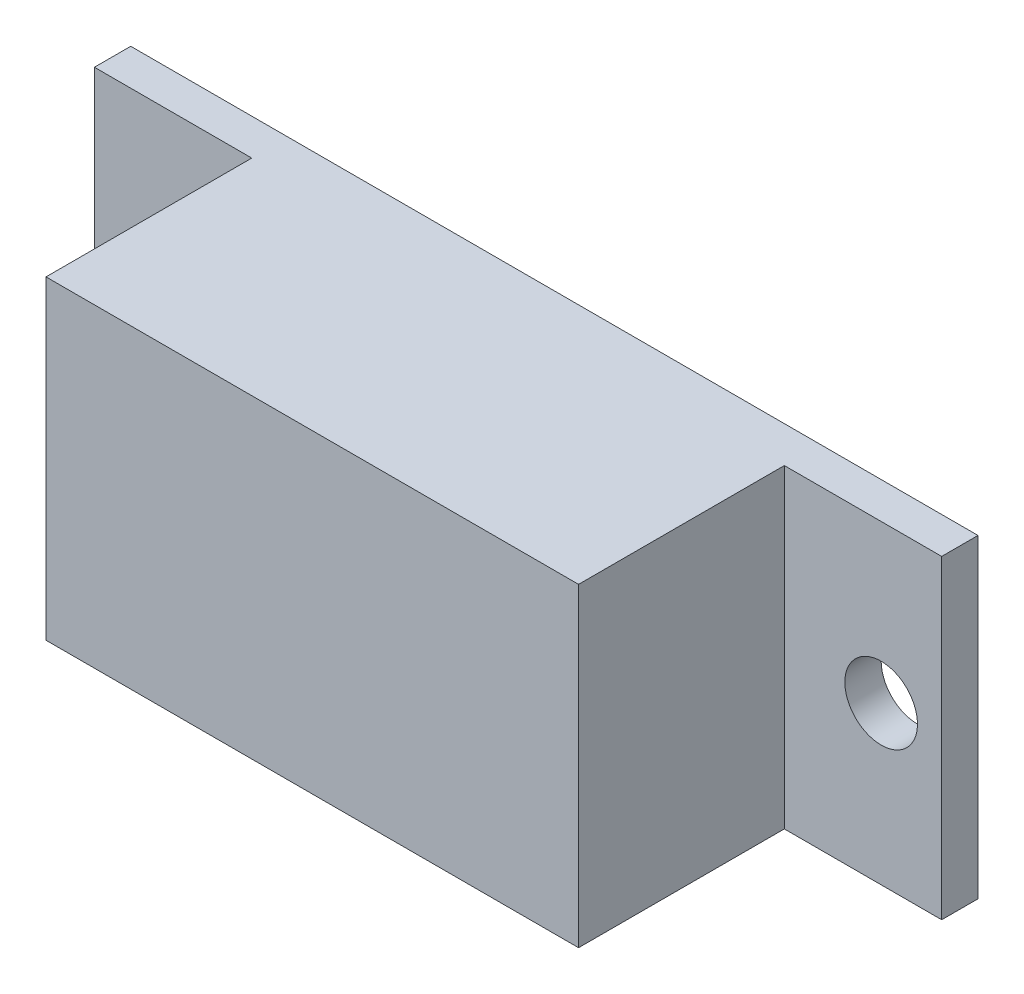
ISO-10303-21;
HEADER;
FILE_DESCRIPTION(('STEP AP214'),'2;1');
FILE_NAME('part.step','',(''),(''),'','','');
FILE_SCHEMA(('AUTOMOTIVE_DESIGN { 1 0 10303 214 1 1 1 1 }'));
ENDSEC;
DATA;
#1=APPLICATION_CONTEXT('core data for automotive mechanical design processes');
#2=APPLICATION_PROTOCOL_DEFINITION('international standard','automotive_design',2000,#1);
#3=PRODUCT_CONTEXT('',#1,'mechanical');
#4=PRODUCT('Part','Part','',(#3));
#5=PRODUCT_RELATED_PRODUCT_CATEGORY('part','',(#4));
#6=PRODUCT_DEFINITION_FORMATION('','',#4);
#7=PRODUCT_DEFINITION_CONTEXT('part definition',#1,'design');
#8=PRODUCT_DEFINITION('design','',#6,#7);
#9=PRODUCT_DEFINITION_SHAPE('','',#8);
#10=(LENGTH_UNIT() NAMED_UNIT(*) SI_UNIT(.MILLI.,.METRE.));
#11=(NAMED_UNIT(*) PLANE_ANGLE_UNIT() SI_UNIT($,.RADIAN.));
#12=(NAMED_UNIT(*) SI_UNIT($,.STERADIAN.) SOLID_ANGLE_UNIT());
#13=UNCERTAINTY_MEASURE_WITH_UNIT(LENGTH_MEASURE(1.E-05),#10,'distance_accuracy_value','');
#14=(GEOMETRIC_REPRESENTATION_CONTEXT(3) GLOBAL_UNCERTAINTY_ASSIGNED_CONTEXT((#13)) GLOBAL_UNIT_ASSIGNED_CONTEXT((#10,
#11,#12)) REPRESENTATION_CONTEXT('',''));
#15=CARTESIAN_POINT('',(0.,0.,0.));
#16=DIRECTION('',(0.,0.,1.));
#17=DIRECTION('',(1.,0.,0.));
#18=AXIS2_PLACEMENT_3D('',#15,#16,#17);
#19=CARTESIAN_POINT('',(0.,0.,1.5));
#20=DIRECTION('',(0.,0.,-1.));
#21=DIRECTION('',(-1.,0.,0.));
#22=AXIS2_PLACEMENT_3D('',#19,#20,#21);
#23=PLANE('',#22);
#24=CARTESIAN_POINT('',(2.5,6.5,1.5));
#25=DIRECTION('',(0.,0.,-1.));
#26=DIRECTION('',(-1.,0.,0.));
#27=AXIS2_PLACEMENT_3D('',#24,#25,#26);
#28=CIRCLE('',#27,1.5);
#29=CARTESIAN_POINT('',(1.,6.5,1.5));
#30=VERTEX_POINT('',#29);
#31=EDGE_CURVE('E410',#30,#30,#28,.T.);
#32=ORIENTED_EDGE('',*,*,#31,.T.);
#33=EDGE_LOOP('',(#32));
#34=FACE_BOUND('',#33,.T.);
#35=DIRECTION('',(0.,-1.,0.));
#36=VECTOR('',#35,1.);
#37=CARTESIAN_POINT('',(6.5,13.,1.5));
#38=LINE('',#37,#36);
#39=CARTESIAN_POINT('',(6.5,13.,1.5));
#40=VERTEX_POINT('',#39);
#41=CARTESIAN_POINT('',(6.5,0.,1.5));
#42=VERTEX_POINT('',#41);
#43=EDGE_CURVE('E58',#40,#42,#38,.T.);
#44=ORIENTED_EDGE('',*,*,#43,.F.);
#45=DIRECTION('',(-1.,0.,0.));
#46=VECTOR('',#45,1.);
#47=CARTESIAN_POINT('',(0.,13.,1.5));
#48=LINE('',#47,#46);
#49=CARTESIAN_POINT('',(0.,13.,1.5));
#50=VERTEX_POINT('',#49);
#51=EDGE_CURVE('E200',#40,#50,#48,.T.);
#52=ORIENTED_EDGE('',*,*,#51,.T.);
#53=DIRECTION('',(0.,-1.,0.));
#54=VECTOR('',#53,1.);
#55=CARTESIAN_POINT('',(0.,0.,1.5));
#56=LINE('',#55,#54);
#57=CARTESIAN_POINT('',(0.,0.,1.5));
#58=VERTEX_POINT('',#57);
#59=EDGE_CURVE('E191',#50,#58,#56,.T.);
#60=ORIENTED_EDGE('',*,*,#59,.T.);
#61=DIRECTION('',(1.,0.,0.));
#62=VECTOR('',#61,1.);
#63=CARTESIAN_POINT('',(0.,0.,1.5));
#64=LINE('',#63,#62);
#65=EDGE_CURVE('E196',#58,#42,#64,.T.);
#66=ORIENTED_EDGE('',*,*,#65,.T.);
#67=EDGE_LOOP('',(#44,#52,#60,#66));
#68=FACE_BOUND('',#67,.T.);
#69=ADVANCED_FACE('F35',(#34,#68),#23,.F.);
#70=CARTESIAN_POINT('',(32.5,6.5,1.5));
#71=DIRECTION('',(0.,0.,-1.));
#72=DIRECTION('',(-1.,0.,0.));
#73=AXIS2_PLACEMENT_3D('',#70,#71,#72);
#74=CIRCLE('',#73,1.5);
#75=CARTESIAN_POINT('',(31.,6.5,1.5));
#76=VERTEX_POINT('',#75);
#77=EDGE_CURVE('E150',#76,#76,#74,.T.);
#78=ORIENTED_EDGE('',*,*,#77,.T.);
#79=EDGE_LOOP('',(#78));
#80=FACE_BOUND('',#79,.T.);
#81=DIRECTION('',(0.,1.,0.));
#82=VECTOR('',#81,1.);
#83=CARTESIAN_POINT('',(28.5,13.,1.5));
#84=LINE('',#83,#82);
#85=CARTESIAN_POINT('',(28.5,0.,1.5));
#86=VERTEX_POINT('',#85);
#87=CARTESIAN_POINT('',(28.5,13.,1.5));
#88=VERTEX_POINT('',#87);
#89=EDGE_CURVE('E169',#86,#88,#84,.T.);
#90=ORIENTED_EDGE('',*,*,#89,.F.);
#91=CARTESIAN_POINT('',(35.,0.,1.5));
#92=VERTEX_POINT('',#91);
#93=EDGE_CURVE('E194',#86,#92,#64,.T.);
#94=ORIENTED_EDGE('',*,*,#93,.T.);
#95=DIRECTION('',(0.,1.,0.));
#96=VECTOR('',#95,1.);
#97=CARTESIAN_POINT('',(35.,0.,1.5));
#98=LINE('',#97,#96);
#99=CARTESIAN_POINT('',(35.,13.,1.5));
#100=VERTEX_POINT('',#99);
#101=EDGE_CURVE('E198',#92,#100,#98,.T.);
#102=ORIENTED_EDGE('',*,*,#101,.T.);
#103=EDGE_CURVE('E201',#100,#88,#48,.T.);
#104=ORIENTED_EDGE('',*,*,#103,.T.);
#105=EDGE_LOOP('',(#90,#94,#102,#104));
#106=FACE_BOUND('',#105,.T.);
#107=ADVANCED_FACE('F249',(#80,#106),#23,.F.);
#108=CARTESIAN_POINT('',(0.,0.,1.5));
#109=DIRECTION('',(1.,0.,0.));
#110=DIRECTION('',(0.,0.,-1.));
#111=AXIS2_PLACEMENT_3D('',#108,#109,#110);
#112=PLANE('',#111);
#113=DIRECTION('',(0.,-1.,0.));
#114=VECTOR('',#113,1.);
#115=CARTESIAN_POINT('',(0.,0.,0.));
#116=LINE('',#115,#114);
#117=CARTESIAN_POINT('',(0.,13.,0.));
#118=VERTEX_POINT('',#117);
#119=CARTESIAN_POINT('',(0.,0.,0.));
#120=VERTEX_POINT('',#119);
#121=EDGE_CURVE('E190',#118,#120,#116,.T.);
#122=ORIENTED_EDGE('',*,*,#121,.T.);
#123=DIRECTION('',(0.,0.,-1.));
#124=VECTOR('',#123,1.);
#125=CARTESIAN_POINT('',(0.,0.,1.5));
#126=LINE('',#125,#124);
#127=EDGE_CURVE('E11',#58,#120,#126,.T.);
#128=ORIENTED_EDGE('',*,*,#127,.F.);
#129=ORIENTED_EDGE('',*,*,#59,.F.);
#130=DIRECTION('',(0.,0.,-1.));
#131=VECTOR('',#130,1.);
#132=CARTESIAN_POINT('',(0.,13.,1.5));
#133=LINE('',#132,#131);
#134=EDGE_CURVE('E203',#50,#118,#133,.T.);
#135=ORIENTED_EDGE('',*,*,#134,.T.);
#136=EDGE_LOOP('',(#122,#128,#129,#135));
#137=FACE_BOUND('',#136,.T.);
#138=ADVANCED_FACE('F37',(#137),#112,.F.);
#139=CARTESIAN_POINT('',(0.,0.,1.5));
#140=DIRECTION('',(0.,1.,0.));
#141=DIRECTION('',(0.,0.,1.));
#142=AXIS2_PLACEMENT_3D('',#139,#140,#141);
#143=PLANE('',#142);
#144=DIRECTION('',(1.,0.,0.));
#145=VECTOR('',#144,1.);
#146=CARTESIAN_POINT('',(0.,0.,0.));
#147=LINE('',#146,#145);
#148=CARTESIAN_POINT('',(35.,0.,0.));
#149=VERTEX_POINT('',#148);
#150=EDGE_CURVE('E206',#120,#149,#147,.T.);
#151=ORIENTED_EDGE('',*,*,#150,.T.);
#152=DIRECTION('',(0.,0.,-1.));
#153=VECTOR('',#152,1.);
#154=CARTESIAN_POINT('',(35.,0.,1.5));
#155=LINE('',#154,#153);
#156=EDGE_CURVE('E43',#92,#149,#155,.T.);
#157=ORIENTED_EDGE('',*,*,#156,.F.);
#158=ORIENTED_EDGE('',*,*,#93,.F.);
#159=DIRECTION('',(0.,0.,-1.));
#160=VECTOR('',#159,1.);
#161=CARTESIAN_POINT('',(28.5,0.,10.));
#162=LINE('',#161,#160);
#163=CARTESIAN_POINT('',(28.5,0.,10.));
#164=VERTEX_POINT('',#163);
#165=EDGE_CURVE('E184',#164,#86,#162,.T.);
#166=ORIENTED_EDGE('',*,*,#165,.F.);
#167=DIRECTION('',(1.,0.,0.));
#168=VECTOR('',#167,1.);
#169=CARTESIAN_POINT('',(6.5,0.,10.));
#170=LINE('',#169,#168);
#171=CARTESIAN_POINT('',(6.5,0.,10.));
#172=VERTEX_POINT('',#171);
#173=EDGE_CURVE('E168',#172,#164,#170,.T.);
#174=ORIENTED_EDGE('',*,*,#173,.F.);
#175=DIRECTION('',(0.,0.,-1.));
#176=VECTOR('',#175,1.);
#177=CARTESIAN_POINT('',(6.5,0.,10.));
#178=LINE('',#177,#176);
#179=EDGE_CURVE('E187',#172,#42,#178,.T.);
#180=ORIENTED_EDGE('',*,*,#179,.T.);
#181=ORIENTED_EDGE('',*,*,#65,.F.);
#182=ORIENTED_EDGE('',*,*,#127,.T.);
#183=EDGE_LOOP('',(#151,#157,#158,#166,#174,#180,#181,#182));
#184=FACE_BOUND('',#183,.T.);
#185=ADVANCED_FACE('F250',(#184),#143,.F.);
#186=CARTESIAN_POINT('',(35.,0.,1.5));
#187=DIRECTION('',(-1.,0.,0.));
#188=DIRECTION('',(0.,0.,1.));
#189=AXIS2_PLACEMENT_3D('',#186,#187,#188);
#190=PLANE('',#189);
#191=DIRECTION('',(0.,1.,0.));
#192=VECTOR('',#191,1.);
#193=CARTESIAN_POINT('',(35.,0.,0.));
#194=LINE('',#193,#192);
#195=CARTESIAN_POINT('',(35.,13.,0.));
#196=VERTEX_POINT('',#195);
#197=EDGE_CURVE('E208',#149,#196,#194,.T.);
#198=ORIENTED_EDGE('',*,*,#197,.T.);
#199=DIRECTION('',(0.,0.,-1.));
#200=VECTOR('',#199,1.);
#201=CARTESIAN_POINT('',(35.,13.,1.5));
#202=LINE('',#201,#200);
#203=EDGE_CURVE('E213',#100,#196,#202,.T.);
#204=ORIENTED_EDGE('',*,*,#203,.F.);
#205=ORIENTED_EDGE('',*,*,#101,.F.);
#206=ORIENTED_EDGE('',*,*,#156,.T.);
#207=EDGE_LOOP('',(#198,#204,#205,#206));
#208=FACE_BOUND('',#207,.T.);
#209=ADVANCED_FACE('F220',(#208),#190,.F.);
#210=CARTESIAN_POINT('',(0.,13.,1.5));
#211=DIRECTION('',(0.,-1.,0.));
#212=DIRECTION('',(0.,0.,-1.));
#213=AXIS2_PLACEMENT_3D('',#210,#211,#212);
#214=PLANE('',#213);
#215=DIRECTION('',(-1.,0.,0.));
#216=VECTOR('',#215,1.);
#217=CARTESIAN_POINT('',(0.,13.,0.));
#218=LINE('',#217,#216);
#219=EDGE_CURVE('E195',#196,#118,#218,.T.);
#220=ORIENTED_EDGE('',*,*,#219,.T.);
#221=ORIENTED_EDGE('',*,*,#134,.F.);
#222=ORIENTED_EDGE('',*,*,#51,.F.);
#223=DIRECTION('',(0.,0.,-1.));
#224=VECTOR('',#223,1.);
#225=CARTESIAN_POINT('',(6.5,13.,10.));
#226=LINE('',#225,#224);
#227=CARTESIAN_POINT('',(6.5,13.,10.));
#228=VERTEX_POINT('',#227);
#229=EDGE_CURVE('E175',#228,#40,#226,.T.);
#230=ORIENTED_EDGE('',*,*,#229,.F.);
#231=DIRECTION('',(-1.,0.,0.));
#232=VECTOR('',#231,1.);
#233=CARTESIAN_POINT('',(6.5,13.,10.));
#234=LINE('',#233,#232);
#235=CARTESIAN_POINT('',(28.5,13.,10.));
#236=VERTEX_POINT('',#235);
#237=EDGE_CURVE('E173',#236,#228,#234,.T.);
#238=ORIENTED_EDGE('',*,*,#237,.F.);
#239=DIRECTION('',(0.,0.,-1.));
#240=VECTOR('',#239,1.);
#241=CARTESIAN_POINT('',(28.5,13.,10.));
#242=LINE('',#241,#240);
#243=EDGE_CURVE('E181',#236,#88,#242,.T.);
#244=ORIENTED_EDGE('',*,*,#243,.T.);
#245=ORIENTED_EDGE('',*,*,#103,.F.);
#246=ORIENTED_EDGE('',*,*,#203,.T.);
#247=EDGE_LOOP('',(#220,#221,#222,#230,#238,#244,#245,#246));
#248=FACE_BOUND('',#247,.T.);
#249=ADVANCED_FACE('F230',(#248),#214,.F.);
#250=CARTESIAN_POINT('',(0.,0.,0.));
#251=DIRECTION('',(0.,0.,-1.));
#252=DIRECTION('',(-1.,0.,0.));
#253=AXIS2_PLACEMENT_3D('',#250,#251,#252);
#254=PLANE('',#253);
#255=CARTESIAN_POINT('',(32.5,6.5,0.));
#256=DIRECTION('',(0.,0.,-1.));
#257=DIRECTION('',(-1.,0.,0.));
#258=AXIS2_PLACEMENT_3D('',#255,#256,#257);
#259=CIRCLE('',#258,1.5);
#260=CARTESIAN_POINT('',(31.,6.5,0.));
#261=VERTEX_POINT('',#260);
#262=EDGE_CURVE('E407',#261,#261,#259,.T.);
#263=ORIENTED_EDGE('',*,*,#262,.F.);
#264=EDGE_LOOP('',(#263));
#265=FACE_BOUND('',#264,.T.);
#266=CARTESIAN_POINT('',(2.5,6.5,0.));
#267=DIRECTION('',(0.,0.,-1.));
#268=DIRECTION('',(-1.,0.,0.));
#269=AXIS2_PLACEMENT_3D('',#266,#267,#268);
#270=CIRCLE('',#269,1.5);
#271=CARTESIAN_POINT('',(1.,6.5,0.));
#272=VERTEX_POINT('',#271);
#273=EDGE_CURVE('E412',#272,#272,#270,.T.);
#274=ORIENTED_EDGE('',*,*,#273,.F.);
#275=EDGE_LOOP('',(#274));
#276=FACE_BOUND('',#275,.T.);
#277=DIRECTION('',(0.,-1.,0.));
#278=VECTOR('',#277,1.);
#279=CARTESIAN_POINT('',(27.5,11.25,0.));
#280=LINE('',#279,#278);
#281=CARTESIAN_POINT('',(27.5,11.25,0.));
#282=VERTEX_POINT('',#281);
#283=CARTESIAN_POINT('',(27.5,1.47966672708568,0.));
#284=VERTEX_POINT('',#283);
#285=EDGE_CURVE('E50',#282,#284,#280,.T.);
#286=ORIENTED_EDGE('',*,*,#285,.F.);
#287=DIRECTION('',(1.,0.,0.));
#288=VECTOR('',#287,1.);
#289=CARTESIAN_POINT('',(27.5,11.25,0.));
#290=LINE('',#289,#288);
#291=CARTESIAN_POINT('',(7.5,11.25,0.));
#292=VERTEX_POINT('',#291);
#293=EDGE_CURVE('E144',#292,#282,#290,.T.);
#294=ORIENTED_EDGE('',*,*,#293,.F.);
#295=DIRECTION('',(0.,1.,0.));
#296=VECTOR('',#295,1.);
#297=CARTESIAN_POINT('',(7.5,11.25,0.));
#298=LINE('',#297,#296);
#299=CARTESIAN_POINT('',(7.5,1.47966672708568,0.));
#300=VERTEX_POINT('',#299);
#301=EDGE_CURVE('E147',#300,#292,#298,.T.);
#302=ORIENTED_EDGE('',*,*,#301,.F.);
#303=DIRECTION('',(-1.,0.,0.));
#304=VECTOR('',#303,1.);
#305=CARTESIAN_POINT('',(27.5,1.47966672708568,0.));
#306=LINE('',#305,#304);
#307=EDGE_CURVE('E156',#284,#300,#306,.T.);
#308=ORIENTED_EDGE('',*,*,#307,.F.);
#309=EDGE_LOOP('',(#286,#294,#302,#308));
#310=FACE_BOUND('',#309,.T.);
#311=ORIENTED_EDGE('',*,*,#121,.F.);
#312=ORIENTED_EDGE('',*,*,#219,.F.);
#313=ORIENTED_EDGE('',*,*,#197,.F.);
#314=ORIENTED_EDGE('',*,*,#150,.F.);
#315=EDGE_LOOP('',(#311,#312,#313,#314));
#316=FACE_BOUND('',#315,.T.);
#317=ADVANCED_FACE('F227',(#265,#276,#310,#316),#254,.T.);
#318=CARTESIAN_POINT('',(6.5,13.,10.));
#319=DIRECTION('',(1.,0.,0.));
#320=DIRECTION('',(0.,1.,0.));
#321=AXIS2_PLACEMENT_3D('',#318,#319,#320);
#322=PLANE('',#321);
#323=ORIENTED_EDGE('',*,*,#43,.T.);
#324=ORIENTED_EDGE('',*,*,#179,.F.);
#325=DIRECTION('',(0.,-1.,0.));
#326=VECTOR('',#325,1.);
#327=CARTESIAN_POINT('',(6.5,13.,10.));
#328=LINE('',#327,#326);
#329=EDGE_CURVE('E165',#228,#172,#328,.T.);
#330=ORIENTED_EDGE('',*,*,#329,.F.);
#331=ORIENTED_EDGE('',*,*,#229,.T.);
#332=EDGE_LOOP('',(#323,#324,#330,#331));
#333=FACE_BOUND('',#332,.T.);
#334=ADVANCED_FACE('F239',(#333),#322,.F.);
#335=CARTESIAN_POINT('',(28.5,13.,10.));
#336=DIRECTION('',(-1.,0.,0.));
#337=DIRECTION('',(0.,-1.,0.));
#338=AXIS2_PLACEMENT_3D('',#335,#336,#337);
#339=PLANE('',#338);
#340=ORIENTED_EDGE('',*,*,#89,.T.);
#341=ORIENTED_EDGE('',*,*,#243,.F.);
#342=DIRECTION('',(0.,1.,0.));
#343=VECTOR('',#342,1.);
#344=CARTESIAN_POINT('',(28.5,13.,10.));
#345=LINE('',#344,#343);
#346=EDGE_CURVE('E171',#164,#236,#345,.T.);
#347=ORIENTED_EDGE('',*,*,#346,.F.);
#348=ORIENTED_EDGE('',*,*,#165,.T.);
#349=EDGE_LOOP('',(#340,#341,#347,#348));
#350=FACE_BOUND('',#349,.T.);
#351=ADVANCED_FACE('F247',(#350),#339,.F.);
#352=CARTESIAN_POINT('',(0.,0.,10.));
#353=DIRECTION('',(0.,0.,1.));
#354=DIRECTION('',(1.,0.,0.));
#355=AXIS2_PLACEMENT_3D('',#352,#353,#354);
#356=PLANE('',#355);
#357=ORIENTED_EDGE('',*,*,#329,.T.);
#358=ORIENTED_EDGE('',*,*,#173,.T.);
#359=ORIENTED_EDGE('',*,*,#346,.T.);
#360=ORIENTED_EDGE('',*,*,#237,.T.);
#361=EDGE_LOOP('',(#357,#358,#359,#360));
#362=FACE_BOUND('',#361,.T.);
#363=ADVANCED_FACE('F242',(#362),#356,.T.);
#364=CARTESIAN_POINT('',(27.5,11.25,2.5));
#365=DIRECTION('',(1.,0.,0.));
#366=DIRECTION('',(0.,1.,0.));
#367=AXIS2_PLACEMENT_3D('',#364,#365,#366);
#368=PLANE('',#367);
#369=ORIENTED_EDGE('',*,*,#285,.T.);
#370=DIRECTION('',(0.,0.,-1.));
#371=VECTOR('',#370,1.);
#372=CARTESIAN_POINT('',(27.5,1.47966672708568,2.5));
#373=LINE('',#372,#371);
#374=CARTESIAN_POINT('',(27.5,1.47966672708568,2.5));
#375=VERTEX_POINT('',#374);
#376=EDGE_CURVE('E122',#375,#284,#373,.T.);
#377=ORIENTED_EDGE('',*,*,#376,.F.);
#378=DIRECTION('',(0.,-1.,0.));
#379=VECTOR('',#378,1.);
#380=CARTESIAN_POINT('',(27.5,11.25,2.5));
#381=LINE('',#380,#379);
#382=CARTESIAN_POINT('',(27.5,11.25,2.5));
#383=VERTEX_POINT('',#382);
#384=EDGE_CURVE('E126',#383,#375,#381,.T.);
#385=ORIENTED_EDGE('',*,*,#384,.F.);
#386=DIRECTION('',(0.,0.,-1.));
#387=VECTOR('',#386,1.);
#388=CARTESIAN_POINT('',(27.5,11.25,2.5));
#389=LINE('',#388,#387);
#390=EDGE_CURVE('E160',#383,#282,#389,.T.);
#391=ORIENTED_EDGE('',*,*,#390,.T.);
#392=EDGE_LOOP('',(#369,#377,#385,#391));
#393=FACE_BOUND('',#392,.T.);
#394=ADVANCED_FACE('F124',(#393),#368,.F.);
#395=CARTESIAN_POINT('',(27.5,11.25,2.5));
#396=DIRECTION('',(0.,1.,0.));
#397=DIRECTION('',(0.,0.,1.));
#398=AXIS2_PLACEMENT_3D('',#395,#396,#397);
#399=PLANE('',#398);
#400=ORIENTED_EDGE('',*,*,#293,.T.);
#401=ORIENTED_EDGE('',*,*,#390,.F.);
#402=DIRECTION('',(1.,0.,0.));
#403=VECTOR('',#402,1.);
#404=CARTESIAN_POINT('',(27.5,11.25,2.5));
#405=LINE('',#404,#403);
#406=CARTESIAN_POINT('',(7.5,11.25,2.5));
#407=VERTEX_POINT('',#406);
#408=EDGE_CURVE('E132',#407,#383,#405,.T.);
#409=ORIENTED_EDGE('',*,*,#408,.F.);
#410=DIRECTION('',(0.,0.,-1.));
#411=VECTOR('',#410,1.);
#412=CARTESIAN_POINT('',(7.5,11.25,2.5));
#413=LINE('',#412,#411);
#414=EDGE_CURVE('E162',#407,#292,#413,.T.);
#415=ORIENTED_EDGE('',*,*,#414,.T.);
#416=EDGE_LOOP('',(#400,#401,#409,#415));
#417=FACE_BOUND('',#416,.T.);
#418=ADVANCED_FACE('F308',(#417),#399,.F.);
#419=CARTESIAN_POINT('',(7.5,11.25,2.5));
#420=DIRECTION('',(-1.,0.,0.));
#421=DIRECTION('',(0.,0.,1.));
#422=AXIS2_PLACEMENT_3D('',#419,#420,#421);
#423=PLANE('',#422);
#424=ORIENTED_EDGE('',*,*,#301,.T.);
#425=ORIENTED_EDGE('',*,*,#414,.F.);
#426=DIRECTION('',(0.,1.,0.));
#427=VECTOR('',#426,1.);
#428=CARTESIAN_POINT('',(7.5,11.25,2.5));
#429=LINE('',#428,#427);
#430=CARTESIAN_POINT('',(7.5,1.47966672708568,2.5));
#431=VERTEX_POINT('',#430);
#432=EDGE_CURVE('E140',#431,#407,#429,.T.);
#433=ORIENTED_EDGE('',*,*,#432,.F.);
#434=DIRECTION('',(0.,0.,-1.));
#435=VECTOR('',#434,1.);
#436=CARTESIAN_POINT('',(7.5,1.47966672708568,2.5));
#437=LINE('',#436,#435);
#438=EDGE_CURVE('E131',#431,#300,#437,.T.);
#439=ORIENTED_EDGE('',*,*,#438,.T.);
#440=EDGE_LOOP('',(#424,#425,#433,#439));
#441=FACE_BOUND('',#440,.T.);
#442=ADVANCED_FACE('F315',(#441),#423,.F.);
#443=CARTESIAN_POINT('',(27.5,1.47966672708568,2.5));
#444=DIRECTION('',(0.,-1.,0.));
#445=DIRECTION('',(0.,0.,-1.));
#446=AXIS2_PLACEMENT_3D('',#443,#444,#445);
#447=PLANE('',#446);
#448=ORIENTED_EDGE('',*,*,#307,.T.);
#449=ORIENTED_EDGE('',*,*,#438,.F.);
#450=DIRECTION('',(-1.,0.,0.));
#451=VECTOR('',#450,1.);
#452=CARTESIAN_POINT('',(27.5,1.47966672708568,2.5));
#453=LINE('',#452,#451);
#454=EDGE_CURVE('E135',#375,#431,#453,.T.);
#455=ORIENTED_EDGE('',*,*,#454,.F.);
#456=ORIENTED_EDGE('',*,*,#376,.T.);
#457=EDGE_LOOP('',(#448,#449,#455,#456));
#458=FACE_BOUND('',#457,.T.);
#459=ADVANCED_FACE('F136',(#458),#447,.F.);
#460=CARTESIAN_POINT('',(0.,0.,2.5));
#461=DIRECTION('',(0.,0.,-1.));
#462=DIRECTION('',(-1.,0.,0.));
#463=AXIS2_PLACEMENT_3D('',#460,#461,#462);
#464=PLANE('',#463);
#465=ORIENTED_EDGE('',*,*,#384,.T.);
#466=ORIENTED_EDGE('',*,*,#454,.T.);
#467=ORIENTED_EDGE('',*,*,#432,.T.);
#468=ORIENTED_EDGE('',*,*,#408,.T.);
#469=EDGE_LOOP('',(#465,#466,#467,#468));
#470=FACE_BOUND('',#469,.T.);
#471=ADVANCED_FACE('F142',(#470),#464,.T.);
#472=CARTESIAN_POINT('',(2.5,6.5,2.5));
#473=DIRECTION('',(0.,0.,-1.));
#474=DIRECTION('',(-1.,0.,0.));
#475=AXIS2_PLACEMENT_3D('',#472,#473,#474);
#476=CYLINDRICAL_SURFACE('',#475,1.5);
#477=ORIENTED_EDGE('',*,*,#273,.T.);
#478=EDGE_LOOP('',(#477));
#479=FACE_BOUND('',#478,.T.);
#480=ORIENTED_EDGE('',*,*,#31,.F.);
#481=EDGE_LOOP('',(#480));
#482=FACE_BOUND('',#481,.T.);
#483=ADVANCED_FACE('F336',(#479,#482),#476,.F.);
#484=CARTESIAN_POINT('',(32.5,6.5,2.5));
#485=DIRECTION('',(0.,0.,-1.));
#486=DIRECTION('',(-1.,0.,0.));
#487=AXIS2_PLACEMENT_3D('',#484,#485,#486);
#488=CYLINDRICAL_SURFACE('',#487,1.5);
#489=ORIENTED_EDGE('',*,*,#262,.T.);
#490=EDGE_LOOP('',(#489));
#491=FACE_BOUND('',#490,.T.);
#492=ORIENTED_EDGE('',*,*,#77,.F.);
#493=EDGE_LOOP('',(#492));
#494=FACE_BOUND('',#493,.T.);
#495=ADVANCED_FACE('F341',(#491,#494),#488,.F.);
#496=CLOSED_SHELL('',(#69,#107,#138,#185,#209,#249,#317,#334,#351,#363,#394,#418,#442,#459,#471,
#483,#495));
#497=MANIFOLD_SOLID_BREP('B2',#496);
#498=ADVANCED_BREP_SHAPE_REPRESENTATION('',(#18,#497),#14);
#499=SHAPE_DEFINITION_REPRESENTATION(#9,#498);
ENDSEC;
END-ISO-10303-21;
